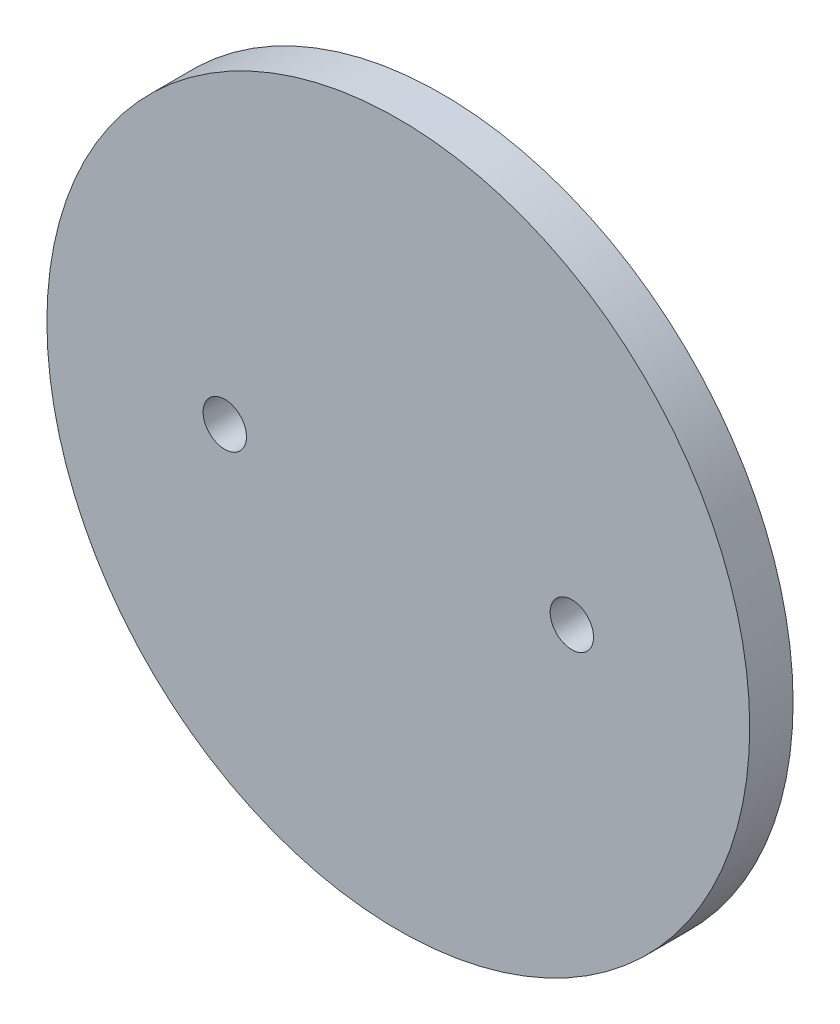
ISO-10303-21;
HEADER;
FILE_DESCRIPTION(('STEP AP214'),'2;1');
FILE_NAME('part.step','',(''),(''),'','','');
FILE_SCHEMA(('AUTOMOTIVE_DESIGN { 1 0 10303 214 1 1 1 1 }'));
ENDSEC;
DATA;
#1=APPLICATION_CONTEXT('core data for automotive mechanical design processes');
#2=APPLICATION_PROTOCOL_DEFINITION('international standard','automotive_design',2000,#1);
#3=PRODUCT_CONTEXT('',#1,'mechanical');
#4=PRODUCT('Part','Part','',(#3));
#5=PRODUCT_RELATED_PRODUCT_CATEGORY('part','',(#4));
#6=PRODUCT_DEFINITION_FORMATION('','',#4);
#7=PRODUCT_DEFINITION_CONTEXT('part definition',#1,'design');
#8=PRODUCT_DEFINITION('design','',#6,#7);
#9=PRODUCT_DEFINITION_SHAPE('','',#8);
#10=(LENGTH_UNIT() NAMED_UNIT(*) SI_UNIT(.MILLI.,.METRE.));
#11=(NAMED_UNIT(*) PLANE_ANGLE_UNIT() SI_UNIT($,.RADIAN.));
#12=(NAMED_UNIT(*) SI_UNIT($,.STERADIAN.) SOLID_ANGLE_UNIT());
#13=UNCERTAINTY_MEASURE_WITH_UNIT(LENGTH_MEASURE(1.E-05),#10,'distance_accuracy_value','');
#14=(GEOMETRIC_REPRESENTATION_CONTEXT(3) GLOBAL_UNCERTAINTY_ASSIGNED_CONTEXT((#13)) GLOBAL_UNIT_ASSIGNED_CONTEXT((#10,
#11,#12)) REPRESENTATION_CONTEXT('',''));
#15=CARTESIAN_POINT('',(0.,0.,0.));
#16=DIRECTION('',(0.,0.,1.));
#17=DIRECTION('',(1.,0.,0.));
#18=AXIS2_PLACEMENT_3D('',#15,#16,#17);
#19=CARTESIAN_POINT('',(0.,0.,2.54));
#20=DIRECTION('',(0.,0.,-1.));
#21=DIRECTION('',(-1.,0.,0.));
#22=AXIS2_PLACEMENT_3D('',#19,#20,#21);
#23=CYLINDRICAL_SURFACE('',#22,20.575);
#24=CARTESIAN_POINT('',(0.,0.,2.54));
#25=DIRECTION('',(0.,0.,1.));
#26=DIRECTION('',(1.,0.,0.));
#27=AXIS2_PLACEMENT_3D('',#24,#25,#26);
#28=CIRCLE('',#27,20.575);
#29=CARTESIAN_POINT('',(20.575,0.,2.54));
#30=VERTEX_POINT('',#29);
#31=EDGE_CURVE('E10',#30,#30,#28,.T.);
#32=ORIENTED_EDGE('',*,*,#31,.F.);
#33=EDGE_LOOP('',(#32));
#34=FACE_BOUND('',#33,.T.);
#35=CARTESIAN_POINT('',(0.,0.,0.));
#36=DIRECTION('',(0.,0.,1.));
#37=DIRECTION('',(1.,0.,0.));
#38=AXIS2_PLACEMENT_3D('',#35,#36,#37);
#39=CIRCLE('',#38,20.575);
#40=CARTESIAN_POINT('',(20.575,0.,0.));
#41=VERTEX_POINT('',#40);
#42=EDGE_CURVE('E35',#41,#41,#39,.T.);
#43=ORIENTED_EDGE('',*,*,#42,.T.);
#44=EDGE_LOOP('',(#43));
#45=FACE_BOUND('',#44,.T.);
#46=ADVANCED_FACE('F32',(#34,#45),#23,.T.);
#47=CARTESIAN_POINT('',(0.,0.,2.54));
#48=DIRECTION('',(0.,0.,1.));
#49=DIRECTION('',(1.,0.,0.));
#50=AXIS2_PLACEMENT_3D('',#47,#48,#49);
#51=PLANE('',#50);
#52=CARTESIAN_POINT('',(-10.16,0.,2.54));
#53=DIRECTION('',(0.,0.,1.));
#54=DIRECTION('',(1.,0.,0.));
#55=AXIS2_PLACEMENT_3D('',#52,#53,#54);
#56=CIRCLE('',#55,1.27);
#57=CARTESIAN_POINT('',(-8.89,0.,2.54));
#58=VERTEX_POINT('',#57);
#59=EDGE_CURVE('E50',#58,#58,#56,.T.);
#60=ORIENTED_EDGE('',*,*,#59,.F.);
#61=EDGE_LOOP('',(#60));
#62=FACE_BOUND('',#61,.T.);
#63=CARTESIAN_POINT('',(10.16,0.,2.54));
#64=DIRECTION('',(0.,0.,1.));
#65=DIRECTION('',(1.,0.,0.));
#66=AXIS2_PLACEMENT_3D('',#63,#64,#65);
#67=CIRCLE('',#66,1.27);
#68=CARTESIAN_POINT('',(11.43,0.,2.54));
#69=VERTEX_POINT('',#68);
#70=EDGE_CURVE('E44',#69,#69,#67,.T.);
#71=ORIENTED_EDGE('',*,*,#70,.F.);
#72=EDGE_LOOP('',(#71));
#73=FACE_BOUND('',#72,.T.);
#74=ORIENTED_EDGE('',*,*,#31,.T.);
#75=EDGE_LOOP('',(#74));
#76=FACE_BOUND('',#75,.T.);
#77=ADVANCED_FACE('F66',(#62,#73,#76),#51,.T.);
#78=CARTESIAN_POINT('',(0.,0.,0.));
#79=DIRECTION('',(0.,0.,1.));
#80=DIRECTION('',(1.,0.,0.));
#81=AXIS2_PLACEMENT_3D('',#78,#79,#80);
#82=PLANE('',#81);
#83=CARTESIAN_POINT('',(-10.16,0.,0.));
#84=DIRECTION('',(0.,0.,1.));
#85=DIRECTION('',(1.,0.,0.));
#86=AXIS2_PLACEMENT_3D('',#83,#84,#85);
#87=CIRCLE('',#86,1.27);
#88=CARTESIAN_POINT('',(-8.89,0.,0.));
#89=VERTEX_POINT('',#88);
#90=EDGE_CURVE('E42',#89,#89,#87,.T.);
#91=ORIENTED_EDGE('',*,*,#90,.T.);
#92=EDGE_LOOP('',(#91));
#93=FACE_BOUND('',#92,.T.);
#94=CARTESIAN_POINT('',(10.16,0.,0.));
#95=DIRECTION('',(0.,0.,1.));
#96=DIRECTION('',(1.,0.,0.));
#97=AXIS2_PLACEMENT_3D('',#94,#95,#96);
#98=CIRCLE('',#97,1.27);
#99=CARTESIAN_POINT('',(11.43,0.,0.));
#100=VERTEX_POINT('',#99);
#101=EDGE_CURVE('E47',#100,#100,#98,.T.);
#102=ORIENTED_EDGE('',*,*,#101,.T.);
#103=EDGE_LOOP('',(#102));
#104=FACE_BOUND('',#103,.T.);
#105=ORIENTED_EDGE('',*,*,#42,.F.);
#106=EDGE_LOOP('',(#105));
#107=FACE_BOUND('',#106,.T.);
#108=ADVANCED_FACE('F56',(#93,#104,#107),#82,.F.);
#109=CARTESIAN_POINT('',(10.16,0.,0.));
#110=DIRECTION('',(0.,0.,1.));
#111=DIRECTION('',(1.,0.,0.));
#112=AXIS2_PLACEMENT_3D('',#109,#110,#111);
#113=CYLINDRICAL_SURFACE('',#112,1.27);
#114=ORIENTED_EDGE('',*,*,#101,.F.);
#115=EDGE_LOOP('',(#114));
#116=FACE_BOUND('',#115,.T.);
#117=ORIENTED_EDGE('',*,*,#70,.T.);
#118=EDGE_LOOP('',(#117));
#119=FACE_BOUND('',#118,.T.);
#120=ADVANCED_FACE('F62',(#116,#119),#113,.F.);
#121=CARTESIAN_POINT('',(-10.16,0.,0.));
#122=DIRECTION('',(0.,0.,1.));
#123=DIRECTION('',(1.,0.,0.));
#124=AXIS2_PLACEMENT_3D('',#121,#122,#123);
#125=CYLINDRICAL_SURFACE('',#124,1.27);
#126=ORIENTED_EDGE('',*,*,#90,.F.);
#127=EDGE_LOOP('',(#126));
#128=FACE_BOUND('',#127,.T.);
#129=ORIENTED_EDGE('',*,*,#59,.T.);
#130=EDGE_LOOP('',(#129));
#131=FACE_BOUND('',#130,.T.);
#132=ADVANCED_FACE('F59',(#128,#131),#125,.F.);
#133=CLOSED_SHELL('',(#46,#77,#108,#120,#132));
#134=MANIFOLD_SOLID_BREP('B2',#133);
#135=ADVANCED_BREP_SHAPE_REPRESENTATION('',(#18,#134),#14);
#136=SHAPE_DEFINITION_REPRESENTATION(#9,#135);
ENDSEC;
END-ISO-10303-21;
